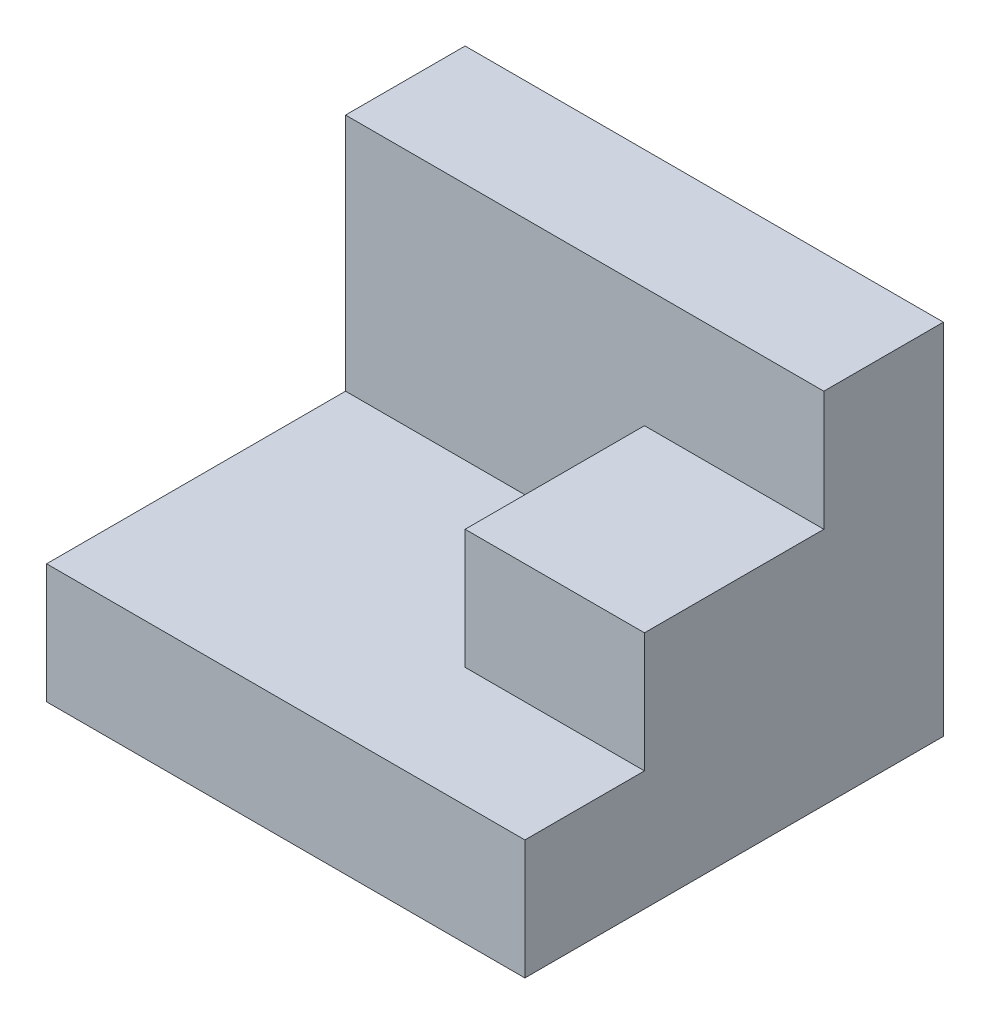
ISO-10303-21;
HEADER;
FILE_DESCRIPTION(('STEP AP214'),'2;1');
FILE_NAME('part.step','',(''),(''),'','','');
FILE_SCHEMA(('AUTOMOTIVE_DESIGN { 1 0 10303 214 1 1 1 1 }'));
ENDSEC;
DATA;
#1=APPLICATION_CONTEXT('core data for automotive mechanical design processes');
#2=APPLICATION_PROTOCOL_DEFINITION('international standard','automotive_design',2000,#1);
#3=PRODUCT_CONTEXT('',#1,'mechanical');
#4=PRODUCT('Part','Part','',(#3));
#5=PRODUCT_RELATED_PRODUCT_CATEGORY('part','',(#4));
#6=PRODUCT_DEFINITION_FORMATION('','',#4);
#7=PRODUCT_DEFINITION_CONTEXT('part definition',#1,'design');
#8=PRODUCT_DEFINITION('design','',#6,#7);
#9=PRODUCT_DEFINITION_SHAPE('','',#8);
#10=(LENGTH_UNIT() NAMED_UNIT(*) SI_UNIT(.MILLI.,.METRE.));
#11=(NAMED_UNIT(*) PLANE_ANGLE_UNIT() SI_UNIT($,.RADIAN.));
#12=(NAMED_UNIT(*) SI_UNIT($,.STERADIAN.) SOLID_ANGLE_UNIT());
#13=UNCERTAINTY_MEASURE_WITH_UNIT(LENGTH_MEASURE(1.E-05),#10,'distance_accuracy_value','');
#14=(GEOMETRIC_REPRESENTATION_CONTEXT(3) GLOBAL_UNCERTAINTY_ASSIGNED_CONTEXT((#13)) GLOBAL_UNIT_ASSIGNED_CONTEXT((#10,
#11,#12)) REPRESENTATION_CONTEXT('',''));
#15=CARTESIAN_POINT('',(0.,0.,0.));
#16=DIRECTION('',(0.,0.,1.));
#17=DIRECTION('',(1.,0.,0.));
#18=AXIS2_PLACEMENT_3D('',#15,#16,#17);
#19=CARTESIAN_POINT('',(-40.,12.7731092436975,-0.105951264332622));
#20=DIRECTION('',(0.,1.,0.));
#21=DIRECTION('',(0.,0.,1.));
#22=AXIS2_PLACEMENT_3D('',#19,#20,#21);
#23=PLANE('',#22);
#24=DIRECTION('',(0.,0.,1.));
#25=VECTOR('',#24,1.);
#26=CARTESIAN_POINT('',(0.,12.7731092436975,-0.105951264332622));
#27=LINE('',#26,#25);
#28=CARTESIAN_POINT('',(0.,12.7731092436975,-10.1059512643326));
#29=VERTEX_POINT('',#28);
#30=CARTESIAN_POINT('',(0.,12.7731092436975,-0.105951264332622));
#31=VERTEX_POINT('',#30);
#32=EDGE_CURVE('E144',#29,#31,#27,.T.);
#33=ORIENTED_EDGE('',*,*,#32,.F.);
#34=DIRECTION('',(1.,0.,0.));
#35=VECTOR('',#34,1.);
#36=CARTESIAN_POINT('',(-40.,12.7731092436975,-10.1059512643326));
#37=LINE('',#36,#35);
#38=CARTESIAN_POINT('',(-40.,12.7731092436975,-10.1059512643326));
#39=VERTEX_POINT('',#38);
#40=EDGE_CURVE('E11',#39,#29,#37,.T.);
#41=ORIENTED_EDGE('',*,*,#40,.F.);
#42=DIRECTION('',(0.,0.,1.));
#43=VECTOR('',#42,1.);
#44=CARTESIAN_POINT('',(-40.,12.7731092436975,-0.105951264332622));
#45=LINE('',#44,#43);
#46=CARTESIAN_POINT('',(-40.,12.7731092436975,-0.105951264332622));
#47=VERTEX_POINT('',#46);
#48=EDGE_CURVE('E164',#39,#47,#45,.T.);
#49=ORIENTED_EDGE('',*,*,#48,.T.);
#50=DIRECTION('',(1.,0.,0.));
#51=VECTOR('',#50,1.);
#52=CARTESIAN_POINT('',(-40.,12.7731092436975,-0.105951264332622));
#53=LINE('',#52,#51);
#54=EDGE_CURVE('E46',#47,#31,#53,.T.);
#55=ORIENTED_EDGE('',*,*,#54,.T.);
#56=EDGE_LOOP('',(#33,#41,#49,#55));
#57=FACE_BOUND('',#56,.T.);
#58=ADVANCED_FACE('F43',(#57),#23,.T.);
#59=CARTESIAN_POINT('',(-40.,12.7731092436975,-10.1059512643326));
#60=DIRECTION('',(0.,0.,-1.));
#61=DIRECTION('',(0.,1.,0.));
#62=AXIS2_PLACEMENT_3D('',#59,#60,#61);
#63=PLANE('',#62);
#64=DIRECTION('',(0.,1.,0.));
#65=VECTOR('',#64,1.);
#66=CARTESIAN_POINT('',(0.,12.7731092436975,-10.1059512643326));
#67=LINE('',#66,#65);
#68=CARTESIAN_POINT('',(0.,-17.2268907563025,-10.1059512643326));
#69=VERTEX_POINT('',#68);
#70=EDGE_CURVE('E161',#69,#29,#67,.T.);
#71=ORIENTED_EDGE('',*,*,#70,.F.);
#72=DIRECTION('',(1.,0.,0.));
#73=VECTOR('',#72,1.);
#74=CARTESIAN_POINT('',(-40.,-17.2268907563025,-10.1059512643326));
#75=LINE('',#74,#73);
#76=CARTESIAN_POINT('',(-40.,-17.2268907563025,-10.1059512643326));
#77=VERTEX_POINT('',#76);
#78=EDGE_CURVE('E52',#77,#69,#75,.T.);
#79=ORIENTED_EDGE('',*,*,#78,.F.);
#80=DIRECTION('',(0.,1.,0.));
#81=VECTOR('',#80,1.);
#82=CARTESIAN_POINT('',(-40.,12.7731092436975,-10.1059512643326));
#83=LINE('',#82,#81);
#84=EDGE_CURVE('E129',#77,#39,#83,.T.);
#85=ORIENTED_EDGE('',*,*,#84,.T.);
#86=ORIENTED_EDGE('',*,*,#40,.T.);
#87=EDGE_LOOP('',(#71,#79,#85,#86));
#88=FACE_BOUND('',#87,.T.);
#89=ADVANCED_FACE('F180',(#88),#63,.T.);
#90=CARTESIAN_POINT('',(-40.,-17.2268907563025,-10.1059512643326));
#91=DIRECTION('',(0.,-1.,0.));
#92=DIRECTION('',(0.,0.,-1.));
#93=AXIS2_PLACEMENT_3D('',#90,#91,#92);
#94=PLANE('',#93);
#95=DIRECTION('',(0.,0.,-1.));
#96=VECTOR('',#95,1.);
#97=CARTESIAN_POINT('',(0.,-17.2268907563025,-10.1059512643326));
#98=LINE('',#97,#96);
#99=CARTESIAN_POINT('',(0.,-17.2268907563025,24.8940487356674));
#100=VERTEX_POINT('',#99);
#101=EDGE_CURVE('E115',#100,#69,#98,.T.);
#102=ORIENTED_EDGE('',*,*,#101,.F.);
#103=DIRECTION('',(1.,0.,0.));
#104=VECTOR('',#103,1.);
#105=CARTESIAN_POINT('',(-40.,-17.2268907563025,24.8940487356674));
#106=LINE('',#105,#104);
#107=CARTESIAN_POINT('',(-40.,-17.2268907563025,24.8940487356674));
#108=VERTEX_POINT('',#107);
#109=EDGE_CURVE('E109',#108,#100,#106,.T.);
#110=ORIENTED_EDGE('',*,*,#109,.F.);
#111=DIRECTION('',(0.,0.,-1.));
#112=VECTOR('',#111,1.);
#113=CARTESIAN_POINT('',(-40.,-17.2268907563025,-10.1059512643326));
#114=LINE('',#113,#112);
#115=EDGE_CURVE('E112',#108,#77,#114,.T.);
#116=ORIENTED_EDGE('',*,*,#115,.T.);
#117=ORIENTED_EDGE('',*,*,#78,.T.);
#118=EDGE_LOOP('',(#102,#110,#116,#117));
#119=FACE_BOUND('',#118,.T.);
#120=ADVANCED_FACE('F111',(#119),#94,.T.);
#121=CARTESIAN_POINT('',(-40.,-17.2268907563025,24.8940487356674));
#122=DIRECTION('',(0.,0.,1.));
#123=DIRECTION('',(1.,0.,0.));
#124=AXIS2_PLACEMENT_3D('',#121,#122,#123);
#125=PLANE('',#124);
#126=DIRECTION('',(0.,-1.,0.));
#127=VECTOR('',#126,1.);
#128=CARTESIAN_POINT('',(0.,-17.2268907563025,24.8940487356674));
#129=LINE('',#128,#127);
#130=CARTESIAN_POINT('',(0.,-7.22689075630253,24.8940487356674));
#131=VERTEX_POINT('',#130);
#132=EDGE_CURVE('E156',#131,#100,#129,.T.);
#133=ORIENTED_EDGE('',*,*,#132,.F.);
#134=DIRECTION('',(1.,0.,0.));
#135=VECTOR('',#134,1.);
#136=CARTESIAN_POINT('',(-40.,-7.22689075630253,24.8940487356674));
#137=LINE('',#136,#135);
#138=CARTESIAN_POINT('',(-40.,-7.22689075630253,24.8940487356674));
#139=VERTEX_POINT('',#138);
#140=EDGE_CURVE('E121',#139,#131,#137,.T.);
#141=ORIENTED_EDGE('',*,*,#140,.F.);
#142=DIRECTION('',(0.,-1.,0.));
#143=VECTOR('',#142,1.);
#144=CARTESIAN_POINT('',(-40.,-17.2268907563025,24.8940487356674));
#145=LINE('',#144,#143);
#146=EDGE_CURVE('E127',#139,#108,#145,.T.);
#147=ORIENTED_EDGE('',*,*,#146,.T.);
#148=ORIENTED_EDGE('',*,*,#109,.T.);
#149=EDGE_LOOP('',(#133,#141,#147,#148));
#150=FACE_BOUND('',#149,.T.);
#151=ADVANCED_FACE('F132',(#150),#125,.T.);
#152=CARTESIAN_POINT('',(-40.,-7.22689075630253,24.8940487356674));
#153=DIRECTION('',(0.,1.,0.));
#154=DIRECTION('',(0.,0.,1.));
#155=AXIS2_PLACEMENT_3D('',#152,#153,#154);
#156=PLANE('',#155);
#157=DIRECTION('',(1.,0.,0.));
#158=VECTOR('',#157,1.);
#159=CARTESIAN_POINT('',(-15.,-7.22689075630253,14.8940487356674));
#160=LINE('',#159,#158);
#161=CARTESIAN_POINT('',(-15.,-7.22689075630253,14.8940487356674));
#162=VERTEX_POINT('',#161);
#163=CARTESIAN_POINT('',(0.,-7.22689075630253,14.8940487356674));
#164=VERTEX_POINT('',#163);
#165=EDGE_CURVE('E149',#162,#164,#160,.T.);
#166=ORIENTED_EDGE('',*,*,#165,.F.);
#167=DIRECTION('',(0.,0.,-1.));
#168=VECTOR('',#167,1.);
#169=CARTESIAN_POINT('',(-15.,-7.22689075630253,-0.105951264332622));
#170=LINE('',#169,#168);
#171=CARTESIAN_POINT('',(-15.,-7.22689075630253,-0.105951264332622));
#172=VERTEX_POINT('',#171);
#173=EDGE_CURVE('E224',#162,#172,#170,.T.);
#174=ORIENTED_EDGE('',*,*,#173,.T.);
#175=DIRECTION('',(1.,0.,0.));
#176=VECTOR('',#175,1.);
#177=CARTESIAN_POINT('',(-40.,-7.22689075630253,-0.105951264332622));
#178=LINE('',#177,#176);
#179=CARTESIAN_POINT('',(-40.,-7.22689075630253,-0.105951264332622));
#180=VERTEX_POINT('',#179);
#181=EDGE_CURVE('E169',#180,#172,#178,.T.);
#182=ORIENTED_EDGE('',*,*,#181,.F.);
#183=DIRECTION('',(0.,0.,1.));
#184=VECTOR('',#183,1.);
#185=CARTESIAN_POINT('',(-40.,-7.22689075630253,24.8940487356674));
#186=LINE('',#185,#184);
#187=EDGE_CURVE('E135',#180,#139,#186,.T.);
#188=ORIENTED_EDGE('',*,*,#187,.T.);
#189=ORIENTED_EDGE('',*,*,#140,.T.);
#190=DIRECTION('',(0.,0.,1.));
#191=VECTOR('',#190,1.);
#192=CARTESIAN_POINT('',(0.,-7.22689075630253,24.8940487356674));
#193=LINE('',#192,#191);
#194=EDGE_CURVE('E153',#164,#131,#193,.T.);
#195=ORIENTED_EDGE('',*,*,#194,.F.);
#196=EDGE_LOOP('',(#166,#174,#182,#188,#189,#195));
#197=FACE_BOUND('',#196,.T.);
#198=ADVANCED_FACE('F193',(#197),#156,.T.);
#199=CARTESIAN_POINT('',(-40.,-7.22689075630253,-0.105951264332622));
#200=DIRECTION('',(0.,0.,1.));
#201=DIRECTION('',(1.,0.,0.));
#202=AXIS2_PLACEMENT_3D('',#199,#200,#201);
#203=PLANE('',#202);
#204=DIRECTION('',(1.,0.,0.));
#205=VECTOR('',#204,1.);
#206=CARTESIAN_POINT('',(-15.,2.77310924369747,-0.105951264332622));
#207=LINE('',#206,#205);
#208=CARTESIAN_POINT('',(-15.,2.77310924369747,-0.105951264332622));
#209=VERTEX_POINT('',#208);
#210=CARTESIAN_POINT('',(0.,2.77310924369747,-0.105951264332622));
#211=VERTEX_POINT('',#210);
#212=EDGE_CURVE('E178',#209,#211,#207,.T.);
#213=ORIENTED_EDGE('',*,*,#212,.T.);
#214=DIRECTION('',(0.,-1.,0.));
#215=VECTOR('',#214,1.);
#216=CARTESIAN_POINT('',(0.,-7.22689075630253,-0.105951264332622));
#217=LINE('',#216,#215);
#218=EDGE_CURVE('E148',#31,#211,#217,.T.);
#219=ORIENTED_EDGE('',*,*,#218,.F.);
#220=ORIENTED_EDGE('',*,*,#54,.F.);
#221=DIRECTION('',(0.,-1.,0.));
#222=VECTOR('',#221,1.);
#223=CARTESIAN_POINT('',(-40.,-7.22689075630253,-0.105951264332622));
#224=LINE('',#223,#222);
#225=EDGE_CURVE('E138',#47,#180,#224,.T.);
#226=ORIENTED_EDGE('',*,*,#225,.T.);
#227=ORIENTED_EDGE('',*,*,#181,.T.);
#228=DIRECTION('',(0.,1.,0.));
#229=VECTOR('',#228,1.);
#230=CARTESIAN_POINT('',(-15.,2.77310924369747,-0.105951264332622));
#231=LINE('',#230,#229);
#232=EDGE_CURVE('E220',#172,#209,#231,.T.);
#233=ORIENTED_EDGE('',*,*,#232,.T.);
#234=EDGE_LOOP('',(#213,#219,#220,#226,#227,#233));
#235=FACE_BOUND('',#234,.T.);
#236=ADVANCED_FACE('F175',(#235),#203,.T.);
#237=CARTESIAN_POINT('',(-40.,0.,0.));
#238=DIRECTION('',(-1.,0.,0.));
#239=DIRECTION('',(0.,0.,1.));
#240=AXIS2_PLACEMENT_3D('',#237,#238,#239);
#241=PLANE('',#240);
#242=ORIENTED_EDGE('',*,*,#48,.F.);
#243=ORIENTED_EDGE('',*,*,#84,.F.);
#244=ORIENTED_EDGE('',*,*,#115,.F.);
#245=ORIENTED_EDGE('',*,*,#146,.F.);
#246=ORIENTED_EDGE('',*,*,#187,.F.);
#247=ORIENTED_EDGE('',*,*,#225,.F.);
#248=EDGE_LOOP('',(#242,#243,#244,#245,#246,#247));
#249=FACE_BOUND('',#248,.T.);
#250=ADVANCED_FACE('F125',(#249),#241,.T.);
#251=CARTESIAN_POINT('',(0.,0.,0.));
#252=DIRECTION('',(-1.,0.,0.));
#253=DIRECTION('',(0.,0.,1.));
#254=AXIS2_PLACEMENT_3D('',#251,#252,#253);
#255=PLANE('',#254);
#256=ORIENTED_EDGE('',*,*,#218,.T.);
#257=DIRECTION('',(0.,0.,1.));
#258=VECTOR('',#257,1.);
#259=CARTESIAN_POINT('',(0.,2.77310924369747,14.8940487356674));
#260=LINE('',#259,#258);
#261=CARTESIAN_POINT('',(0.,2.77310924369747,14.8940487356674));
#262=VERTEX_POINT('',#261);
#263=EDGE_CURVE('E244',#211,#262,#260,.T.);
#264=ORIENTED_EDGE('',*,*,#263,.T.);
#265=DIRECTION('',(0.,-1.,0.));
#266=VECTOR('',#265,1.);
#267=CARTESIAN_POINT('',(0.,-7.22689075630253,14.8940487356674));
#268=LINE('',#267,#266);
#269=EDGE_CURVE('E60',#262,#164,#268,.T.);
#270=ORIENTED_EDGE('',*,*,#269,.T.);
#271=ORIENTED_EDGE('',*,*,#194,.T.);
#272=ORIENTED_EDGE('',*,*,#132,.T.);
#273=ORIENTED_EDGE('',*,*,#101,.T.);
#274=ORIENTED_EDGE('',*,*,#70,.T.);
#275=ORIENTED_EDGE('',*,*,#32,.T.);
#276=EDGE_LOOP('',(#256,#264,#270,#271,#272,#273,#274,#275));
#277=FACE_BOUND('',#276,.T.);
#278=ADVANCED_FACE('F179',(#277),#255,.F.);
#279=CARTESIAN_POINT('',(-15.,-7.22689075630253,14.8940487356674));
#280=DIRECTION('',(0.,0.,1.));
#281=DIRECTION('',(1.,0.,0.));
#282=AXIS2_PLACEMENT_3D('',#279,#280,#281);
#283=PLANE('',#282);
#284=ORIENTED_EDGE('',*,*,#269,.F.);
#285=DIRECTION('',(1.,0.,0.));
#286=VECTOR('',#285,1.);
#287=CARTESIAN_POINT('',(-15.,2.77310924369747,14.8940487356674));
#288=LINE('',#287,#286);
#289=CARTESIAN_POINT('',(-15.,2.77310924369747,14.8940487356674));
#290=VERTEX_POINT('',#289);
#291=EDGE_CURVE('E238',#290,#262,#288,.T.);
#292=ORIENTED_EDGE('',*,*,#291,.F.);
#293=DIRECTION('',(0.,-1.,0.));
#294=VECTOR('',#293,1.);
#295=CARTESIAN_POINT('',(-15.,-7.22689075630253,14.8940487356674));
#296=LINE('',#295,#294);
#297=EDGE_CURVE('E234',#290,#162,#296,.T.);
#298=ORIENTED_EDGE('',*,*,#297,.T.);
#299=ORIENTED_EDGE('',*,*,#165,.T.);
#300=EDGE_LOOP('',(#284,#292,#298,#299));
#301=FACE_BOUND('',#300,.T.);
#302=ADVANCED_FACE('F203',(#301),#283,.T.);
#303=CARTESIAN_POINT('',(-15.,2.77310924369747,14.8940487356674));
#304=DIRECTION('',(0.,1.,0.));
#305=DIRECTION('',(0.,0.,1.));
#306=AXIS2_PLACEMENT_3D('',#303,#304,#305);
#307=PLANE('',#306);
#308=ORIENTED_EDGE('',*,*,#263,.F.);
#309=ORIENTED_EDGE('',*,*,#212,.F.);
#310=DIRECTION('',(0.,0.,1.));
#311=VECTOR('',#310,1.);
#312=CARTESIAN_POINT('',(-15.,2.77310924369747,14.8940487356674));
#313=LINE('',#312,#311);
#314=EDGE_CURVE('E228',#209,#290,#313,.T.);
#315=ORIENTED_EDGE('',*,*,#314,.T.);
#316=ORIENTED_EDGE('',*,*,#291,.T.);
#317=EDGE_LOOP('',(#308,#309,#315,#316));
#318=FACE_BOUND('',#317,.T.);
#319=ADVANCED_FACE('F205',(#318),#307,.T.);
#320=CARTESIAN_POINT('',(-15.,0.,0.));
#321=DIRECTION('',(-1.,0.,0.));
#322=DIRECTION('',(0.,0.,1.));
#323=AXIS2_PLACEMENT_3D('',#320,#321,#322);
#324=PLANE('',#323);
#325=ORIENTED_EDGE('',*,*,#232,.F.);
#326=ORIENTED_EDGE('',*,*,#173,.F.);
#327=ORIENTED_EDGE('',*,*,#297,.F.);
#328=ORIENTED_EDGE('',*,*,#314,.F.);
#329=EDGE_LOOP('',(#325,#326,#327,#328));
#330=FACE_BOUND('',#329,.T.);
#331=ADVANCED_FACE('F208',(#330),#324,.T.);
#332=CLOSED_SHELL('',(#58,#89,#120,#151,#198,#236,#250,#278,#302,#319,#331));
#333=MANIFOLD_SOLID_BREP('B2',#332);
#334=ADVANCED_BREP_SHAPE_REPRESENTATION('',(#18,#333),#14);
#335=SHAPE_DEFINITION_REPRESENTATION(#9,#334);
ENDSEC;
END-ISO-10303-21;
